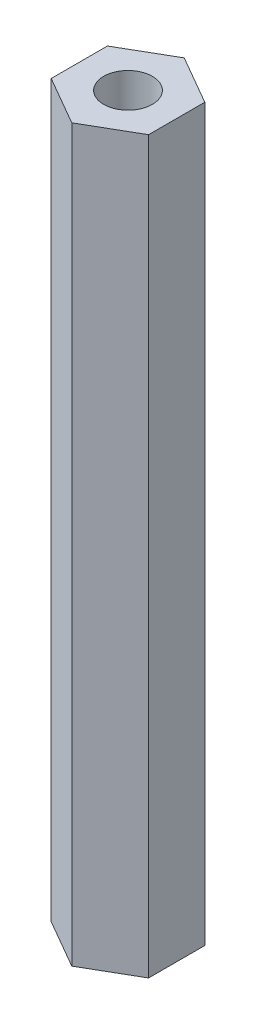
ISO-10303-21;
HEADER;
FILE_DESCRIPTION(('STEP AP214'),'2;1');
FILE_NAME('part.step','',(''),(''),'','','');
FILE_SCHEMA(('AUTOMOTIVE_DESIGN { 1 0 10303 214 1 1 1 1 }'));
ENDSEC;
DATA;
#1=APPLICATION_CONTEXT('core data for automotive mechanical design processes');
#2=APPLICATION_PROTOCOL_DEFINITION('international standard','automotive_design',2000,#1);
#3=PRODUCT_CONTEXT('',#1,'mechanical');
#4=PRODUCT('Part','Part','',(#3));
#5=PRODUCT_RELATED_PRODUCT_CATEGORY('part','',(#4));
#6=PRODUCT_DEFINITION_FORMATION('','',#4);
#7=PRODUCT_DEFINITION_CONTEXT('part definition',#1,'design');
#8=PRODUCT_DEFINITION('design','',#6,#7);
#9=PRODUCT_DEFINITION_SHAPE('','',#8);
#10=(LENGTH_UNIT() NAMED_UNIT(*) SI_UNIT(.MILLI.,.METRE.));
#11=(NAMED_UNIT(*) PLANE_ANGLE_UNIT() SI_UNIT($,.RADIAN.));
#12=(NAMED_UNIT(*) SI_UNIT($,.STERADIAN.) SOLID_ANGLE_UNIT());
#13=UNCERTAINTY_MEASURE_WITH_UNIT(LENGTH_MEASURE(1.E-05),#10,'distance_accuracy_value','');
#14=(GEOMETRIC_REPRESENTATION_CONTEXT(3) GLOBAL_UNCERTAINTY_ASSIGNED_CONTEXT((#13)) GLOBAL_UNIT_ASSIGNED_CONTEXT((#10,
#11,#12)) REPRESENTATION_CONTEXT('',''));
#15=CARTESIAN_POINT('',(0.,0.,0.));
#16=DIRECTION('',(0.,0.,1.));
#17=DIRECTION('',(1.,0.,0.));
#18=AXIS2_PLACEMENT_3D('',#15,#16,#17);
#19=CARTESIAN_POINT('',(0.,45.,0.));
#20=DIRECTION('',(0.,1.,0.));
#21=DIRECTION('',(0.,0.,1.));
#22=AXIS2_PLACEMENT_3D('',#19,#20,#21);
#23=PLANE('',#22);
#24=DIRECTION('',(0.866025403784438,0.,-0.5));
#25=VECTOR('',#24,1.);
#26=CARTESIAN_POINT('',(0.,45.,3.46410161513778));
#27=LINE('',#26,#25);
#28=CARTESIAN_POINT('',(0.,45.,3.46410161513778));
#29=VERTEX_POINT('',#28);
#30=CARTESIAN_POINT('',(2.99999999999999,45.,1.7320508075689));
#31=VERTEX_POINT('',#30);
#32=EDGE_CURVE('E129',#29,#31,#27,.T.);
#33=ORIENTED_EDGE('',*,*,#32,.T.);
#34=DIRECTION('',(0.,0.,-1.));
#35=VECTOR('',#34,1.);
#36=CARTESIAN_POINT('',(2.99999999999999,45.,1.7320508075689));
#37=LINE('',#36,#35);
#38=CARTESIAN_POINT('',(3.,45.,-1.73205080756891));
#39=VERTEX_POINT('',#38);
#40=EDGE_CURVE('E87',#31,#39,#37,.T.);
#41=ORIENTED_EDGE('',*,*,#40,.T.);
#42=DIRECTION('',(-0.866025403784439,0.,-0.5));
#43=VECTOR('',#42,1.);
#44=CARTESIAN_POINT('',(3.,45.,-1.73205080756891));
#45=LINE('',#44,#43);
#46=CARTESIAN_POINT('',(0.,45.,-3.4641016151378));
#47=VERTEX_POINT('',#46);
#48=EDGE_CURVE('E100',#39,#47,#45,.T.);
#49=ORIENTED_EDGE('',*,*,#48,.T.);
#50=DIRECTION('',(-0.866025403784438,0.,0.500000000000002));
#51=VECTOR('',#50,1.);
#52=CARTESIAN_POINT('',(0.,45.,-3.4641016151378));
#53=LINE('',#52,#51);
#54=CARTESIAN_POINT('',(-3.00000000000003,45.,-1.7320508075689));
#55=VERTEX_POINT('',#54);
#56=EDGE_CURVE('E94',#47,#55,#53,.T.);
#57=ORIENTED_EDGE('',*,*,#56,.T.);
#58=DIRECTION('',(0.,0.,1.));
#59=VECTOR('',#58,1.);
#60=CARTESIAN_POINT('',(-3.00000000000003,45.,-1.7320508075689));
#61=LINE('',#60,#59);
#62=CARTESIAN_POINT('',(-3.00000000000002,45.,1.73205080756889));
#63=VERTEX_POINT('',#62);
#64=EDGE_CURVE('E98',#55,#63,#61,.T.);
#65=ORIENTED_EDGE('',*,*,#64,.T.);
#66=DIRECTION('',(0.866025403784438,0.,0.500000000000001));
#67=VECTOR('',#66,1.);
#68=CARTESIAN_POINT('',(-3.00000000000002,45.,1.73205080756889));
#69=LINE('',#68,#67);
#70=EDGE_CURVE('E50',#63,#29,#69,.T.);
#71=ORIENTED_EDGE('',*,*,#70,.T.);
#72=EDGE_LOOP('',(#33,#41,#49,#57,#65,#71));
#73=FACE_BOUND('',#72,.T.);
#74=CARTESIAN_POINT('',(0.,45.,0.));
#75=DIRECTION('',(0.,1.,0.));
#76=DIRECTION('',(0.,0.,1.));
#77=AXIS2_PLACEMENT_3D('',#74,#75,#76);
#78=CIRCLE('',#77,1.5);
#79=CARTESIAN_POINT('',(0.,45.,1.5));
#80=VERTEX_POINT('',#79);
#81=EDGE_CURVE('E122',#80,#80,#78,.T.);
#82=ORIENTED_EDGE('',*,*,#81,.F.);
#83=EDGE_LOOP('',(#82));
#84=FACE_BOUND('',#83,.T.);
#85=ADVANCED_FACE('F33',(#73,#84),#23,.T.);
#86=CARTESIAN_POINT('',(0.,0.,0.));
#87=DIRECTION('',(0.,1.,0.));
#88=DIRECTION('',(0.,0.,1.));
#89=AXIS2_PLACEMENT_3D('',#86,#87,#88);
#90=PLANE('',#89);
#91=DIRECTION('',(0.866025403784438,0.,-0.5));
#92=VECTOR('',#91,1.);
#93=CARTESIAN_POINT('',(0.,0.,3.46410161513778));
#94=LINE('',#93,#92);
#95=CARTESIAN_POINT('',(0.,0.,3.46410161513778));
#96=VERTEX_POINT('',#95);
#97=CARTESIAN_POINT('',(2.99999999999999,0.,1.7320508075689));
#98=VERTEX_POINT('',#97);
#99=EDGE_CURVE('E118',#96,#98,#94,.T.);
#100=ORIENTED_EDGE('',*,*,#99,.F.);
#101=DIRECTION('',(0.866025403784438,0.,0.500000000000001));
#102=VECTOR('',#101,1.);
#103=CARTESIAN_POINT('',(-3.00000000000002,0.,1.73205080756889));
#104=LINE('',#103,#102);
#105=CARTESIAN_POINT('',(-3.00000000000002,0.,1.73205080756889));
#106=VERTEX_POINT('',#105);
#107=EDGE_CURVE('E79',#106,#96,#104,.T.);
#108=ORIENTED_EDGE('',*,*,#107,.F.);
#109=DIRECTION('',(0.,0.,1.));
#110=VECTOR('',#109,1.);
#111=CARTESIAN_POINT('',(-3.00000000000003,0.,-1.7320508075689));
#112=LINE('',#111,#110);
#113=CARTESIAN_POINT('',(-3.00000000000003,0.,-1.7320508075689));
#114=VERTEX_POINT('',#113);
#115=EDGE_CURVE('E73',#114,#106,#112,.T.);
#116=ORIENTED_EDGE('',*,*,#115,.F.);
#117=DIRECTION('',(-0.866025403784438,0.,0.500000000000002));
#118=VECTOR('',#117,1.);
#119=CARTESIAN_POINT('',(0.,0.,-3.4641016151378));
#120=LINE('',#119,#118);
#121=CARTESIAN_POINT('',(0.,0.,-3.4641016151378));
#122=VERTEX_POINT('',#121);
#123=EDGE_CURVE('E108',#122,#114,#120,.T.);
#124=ORIENTED_EDGE('',*,*,#123,.F.);
#125=DIRECTION('',(-0.866025403784439,0.,-0.5));
#126=VECTOR('',#125,1.);
#127=CARTESIAN_POINT('',(3.,0.,-1.73205080756891));
#128=LINE('',#127,#126);
#129=CARTESIAN_POINT('',(3.,0.,-1.73205080756891));
#130=VERTEX_POINT('',#129);
#131=EDGE_CURVE('E124',#130,#122,#128,.T.);
#132=ORIENTED_EDGE('',*,*,#131,.F.);
#133=DIRECTION('',(0.,0.,-1.));
#134=VECTOR('',#133,1.);
#135=CARTESIAN_POINT('',(2.99999999999999,0.,1.7320508075689));
#136=LINE('',#135,#134);
#137=EDGE_CURVE('E121',#98,#130,#136,.T.);
#138=ORIENTED_EDGE('',*,*,#137,.F.);
#139=EDGE_LOOP('',(#100,#108,#116,#124,#132,#138));
#140=FACE_BOUND('',#139,.T.);
#141=CARTESIAN_POINT('',(0.,0.,0.));
#142=DIRECTION('',(0.,1.,0.));
#143=DIRECTION('',(0.,0.,1.));
#144=AXIS2_PLACEMENT_3D('',#141,#142,#143);
#145=CIRCLE('',#144,1.5);
#146=CARTESIAN_POINT('',(0.,0.,1.5));
#147=VERTEX_POINT('',#146);
#148=EDGE_CURVE('E222',#147,#147,#145,.T.);
#149=ORIENTED_EDGE('',*,*,#148,.T.);
#150=EDGE_LOOP('',(#149));
#151=FACE_BOUND('',#150,.T.);
#152=ADVANCED_FACE('F138',(#140,#151),#90,.F.);
#153=CARTESIAN_POINT('',(0.,45.,3.46410161513778));
#154=DIRECTION('',(-0.5,0.,-0.866025403784438));
#155=DIRECTION('',(-0.866025403784438,0.,0.5));
#156=AXIS2_PLACEMENT_3D('',#153,#154,#155);
#157=PLANE('',#156);
#158=ORIENTED_EDGE('',*,*,#99,.T.);
#159=DIRECTION('',(0.,-1.,0.));
#160=VECTOR('',#159,1.);
#161=CARTESIAN_POINT('',(2.99999999999999,45.,1.7320508075689));
#162=LINE('',#161,#160);
#163=EDGE_CURVE('E11',#31,#98,#162,.T.);
#164=ORIENTED_EDGE('',*,*,#163,.F.);
#165=ORIENTED_EDGE('',*,*,#32,.F.);
#166=DIRECTION('',(0.,-1.,0.));
#167=VECTOR('',#166,1.);
#168=CARTESIAN_POINT('',(0.,45.,3.46410161513778));
#169=LINE('',#168,#167);
#170=EDGE_CURVE('E114',#29,#96,#169,.T.);
#171=ORIENTED_EDGE('',*,*,#170,.T.);
#172=EDGE_LOOP('',(#158,#164,#165,#171));
#173=FACE_BOUND('',#172,.T.);
#174=ADVANCED_FACE('F35',(#173),#157,.F.);
#175=CARTESIAN_POINT('',(2.99999999999999,45.,1.7320508075689));
#176=DIRECTION('',(-1.,0.,0.));
#177=DIRECTION('',(0.,0.,1.));
#178=AXIS2_PLACEMENT_3D('',#175,#176,#177);
#179=PLANE('',#178);
#180=ORIENTED_EDGE('',*,*,#137,.T.);
#181=DIRECTION('',(0.,-1.,0.));
#182=VECTOR('',#181,1.);
#183=CARTESIAN_POINT('',(3.,45.,-1.73205080756891));
#184=LINE('',#183,#182);
#185=EDGE_CURVE('E42',#39,#130,#184,.T.);
#186=ORIENTED_EDGE('',*,*,#185,.F.);
#187=ORIENTED_EDGE('',*,*,#40,.F.);
#188=ORIENTED_EDGE('',*,*,#163,.T.);
#189=EDGE_LOOP('',(#180,#186,#187,#188));
#190=FACE_BOUND('',#189,.T.);
#191=ADVANCED_FACE('F163',(#190),#179,.F.);
#192=CARTESIAN_POINT('',(3.,45.,-1.73205080756891));
#193=DIRECTION('',(-0.5,0.,0.866025403784438));
#194=DIRECTION('',(0.866025403784439,0.,0.5));
#195=AXIS2_PLACEMENT_3D('',#192,#193,#194);
#196=PLANE('',#195);
#197=ORIENTED_EDGE('',*,*,#131,.T.);
#198=DIRECTION('',(0.,-1.,0.));
#199=VECTOR('',#198,1.);
#200=CARTESIAN_POINT('',(0.,45.,-3.4641016151378));
#201=LINE('',#200,#199);
#202=EDGE_CURVE('E109',#47,#122,#201,.T.);
#203=ORIENTED_EDGE('',*,*,#202,.F.);
#204=ORIENTED_EDGE('',*,*,#48,.F.);
#205=ORIENTED_EDGE('',*,*,#185,.T.);
#206=EDGE_LOOP('',(#197,#203,#204,#205));
#207=FACE_BOUND('',#206,.T.);
#208=ADVANCED_FACE('F135',(#207),#196,.F.);
#209=CARTESIAN_POINT('',(0.,45.,-3.4641016151378));
#210=DIRECTION('',(0.500000000000002,0.,0.866025403784438));
#211=DIRECTION('',(0.866025403784438,0.,-0.500000000000002));
#212=AXIS2_PLACEMENT_3D('',#209,#210,#211);
#213=PLANE('',#212);
#214=ORIENTED_EDGE('',*,*,#123,.T.);
#215=DIRECTION('',(0.,-1.,0.));
#216=VECTOR('',#215,1.);
#217=CARTESIAN_POINT('',(-3.00000000000003,45.,-1.7320508075689));
#218=LINE('',#217,#216);
#219=EDGE_CURVE('E105',#55,#114,#218,.T.);
#220=ORIENTED_EDGE('',*,*,#219,.F.);
#221=ORIENTED_EDGE('',*,*,#56,.F.);
#222=ORIENTED_EDGE('',*,*,#202,.T.);
#223=EDGE_LOOP('',(#214,#220,#221,#222));
#224=FACE_BOUND('',#223,.T.);
#225=ADVANCED_FACE('F106',(#224),#213,.F.);
#226=CARTESIAN_POINT('',(-3.00000000000003,45.,-1.7320508075689));
#227=DIRECTION('',(1.,0.,0.));
#228=DIRECTION('',(0.,0.,-1.));
#229=AXIS2_PLACEMENT_3D('',#226,#227,#228);
#230=PLANE('',#229);
#231=ORIENTED_EDGE('',*,*,#115,.T.);
#232=DIRECTION('',(0.,-1.,0.));
#233=VECTOR('',#232,1.);
#234=CARTESIAN_POINT('',(-3.00000000000002,45.,1.73205080756889));
#235=LINE('',#234,#233);
#236=EDGE_CURVE('E110',#63,#106,#235,.T.);
#237=ORIENTED_EDGE('',*,*,#236,.F.);
#238=ORIENTED_EDGE('',*,*,#64,.F.);
#239=ORIENTED_EDGE('',*,*,#219,.T.);
#240=EDGE_LOOP('',(#231,#237,#238,#239));
#241=FACE_BOUND('',#240,.T.);
#242=ADVANCED_FACE('F112',(#241),#230,.F.);
#243=CARTESIAN_POINT('',(-3.00000000000002,45.,1.73205080756889));
#244=DIRECTION('',(0.500000000000001,0.,-0.866025403784438));
#245=DIRECTION('',(-0.866025403784438,0.,-0.500000000000001));
#246=AXIS2_PLACEMENT_3D('',#243,#244,#245);
#247=PLANE('',#246);
#248=ORIENTED_EDGE('',*,*,#107,.T.);
#249=ORIENTED_EDGE('',*,*,#170,.F.);
#250=ORIENTED_EDGE('',*,*,#70,.F.);
#251=ORIENTED_EDGE('',*,*,#236,.T.);
#252=EDGE_LOOP('',(#248,#249,#250,#251));
#253=FACE_BOUND('',#252,.T.);
#254=ADVANCED_FACE('F143',(#253),#247,.F.);
#255=CARTESIAN_POINT('',(0.,45.,0.));
#256=DIRECTION('',(0.,-1.,0.));
#257=DIRECTION('',(0.,0.,-1.));
#258=AXIS2_PLACEMENT_3D('',#255,#256,#257);
#259=CYLINDRICAL_SURFACE('',#258,1.5);
#260=ORIENTED_EDGE('',*,*,#81,.T.);
#261=EDGE_LOOP('',(#260));
#262=FACE_BOUND('',#261,.T.);
#263=ORIENTED_EDGE('',*,*,#148,.F.);
#264=EDGE_LOOP('',(#263));
#265=FACE_BOUND('',#264,.T.);
#266=ADVANCED_FACE('F145',(#262,#265),#259,.F.);
#267=CLOSED_SHELL('',(#85,#152,#174,#191,#208,#225,#242,#254,#266));
#268=MANIFOLD_SOLID_BREP('B2',#267);
#269=ADVANCED_BREP_SHAPE_REPRESENTATION('',(#18,#268),#14);
#270=SHAPE_DEFINITION_REPRESENTATION(#9,#269);
ENDSEC;
END-ISO-10303-21;
